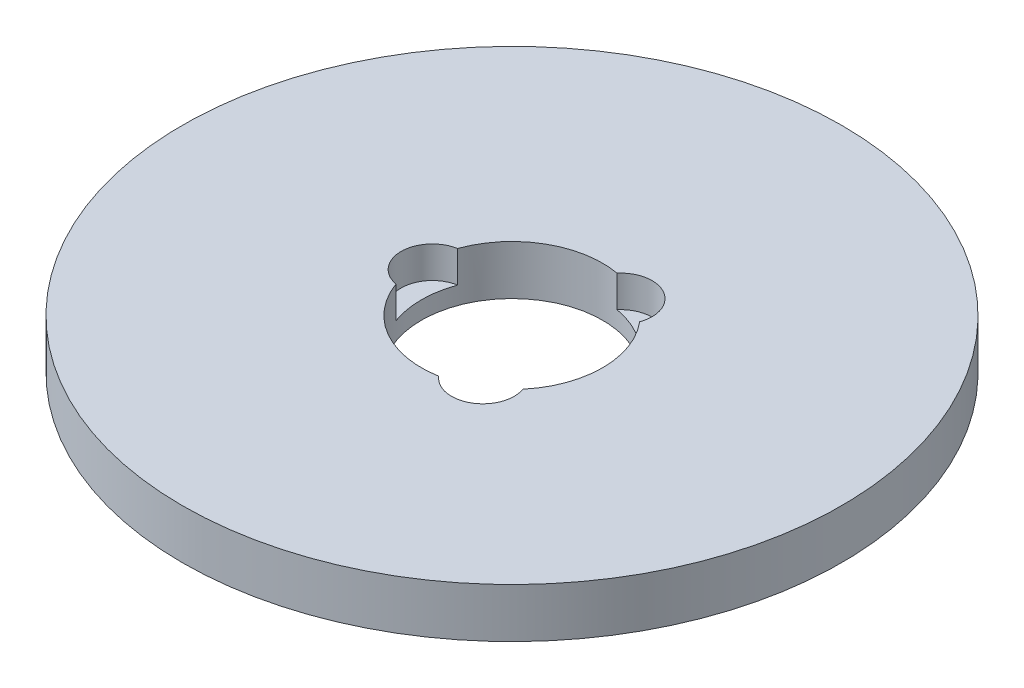
ISO-10303-21;
HEADER;
FILE_DESCRIPTION(('STEP AP214'),'2;1');
FILE_NAME('part.step','',(''),(''),'','','');
FILE_SCHEMA(('AUTOMOTIVE_DESIGN { 1 0 10303 214 1 1 1 1 }'));
ENDSEC;
DATA;
#1=APPLICATION_CONTEXT('core data for automotive mechanical design processes');
#2=APPLICATION_PROTOCOL_DEFINITION('international standard','automotive_design',2000,#1);
#3=PRODUCT_CONTEXT('',#1,'mechanical');
#4=PRODUCT('Part','Part','',(#3));
#5=PRODUCT_RELATED_PRODUCT_CATEGORY('part','',(#4));
#6=PRODUCT_DEFINITION_FORMATION('','',#4);
#7=PRODUCT_DEFINITION_CONTEXT('part definition',#1,'design');
#8=PRODUCT_DEFINITION('design','',#6,#7);
#9=PRODUCT_DEFINITION_SHAPE('','',#8);
#10=(LENGTH_UNIT() NAMED_UNIT(*) SI_UNIT(.MILLI.,.METRE.));
#11=(NAMED_UNIT(*) PLANE_ANGLE_UNIT() SI_UNIT($,.RADIAN.));
#12=(NAMED_UNIT(*) SI_UNIT($,.STERADIAN.) SOLID_ANGLE_UNIT());
#13=UNCERTAINTY_MEASURE_WITH_UNIT(LENGTH_MEASURE(1.E-05),#10,'distance_accuracy_value','');
#14=(GEOMETRIC_REPRESENTATION_CONTEXT(3) GLOBAL_UNCERTAINTY_ASSIGNED_CONTEXT((#13)) GLOBAL_UNIT_ASSIGNED_CONTEXT((#10,
#11,#12)) REPRESENTATION_CONTEXT('',''));
#15=CARTESIAN_POINT('',(0.,0.,0.));
#16=DIRECTION('',(0.,0.,1.));
#17=DIRECTION('',(1.,0.,0.));
#18=AXIS2_PLACEMENT_3D('',#15,#16,#17);
#19=CARTESIAN_POINT('',(0.,15.,0.));
#20=DIRECTION('',(0.,-1.,0.));
#21=DIRECTION('',(0.,0.,-1.));
#22=AXIS2_PLACEMENT_3D('',#19,#20,#21);
#23=CYLINDRICAL_SURFACE('',#22,100.);
#24=CARTESIAN_POINT('',(0.,15.,0.));
#25=DIRECTION('',(0.,1.,0.));
#26=DIRECTION('',(0.,0.,1.));
#27=AXIS2_PLACEMENT_3D('',#24,#25,#26);
#28=CIRCLE('',#27,100.);
#29=CARTESIAN_POINT('',(0.,15.,100.));
#30=VERTEX_POINT('',#29);
#31=EDGE_CURVE('E130',#30,#30,#28,.T.);
#32=ORIENTED_EDGE('',*,*,#31,.F.);
#33=EDGE_LOOP('',(#32));
#34=FACE_BOUND('',#33,.T.);
#35=CARTESIAN_POINT('',(0.,0.,0.));
#36=DIRECTION('',(0.,1.,0.));
#37=DIRECTION('',(0.,0.,1.));
#38=AXIS2_PLACEMENT_3D('',#35,#36,#37);
#39=CIRCLE('',#38,100.);
#40=CARTESIAN_POINT('',(0.,0.,100.));
#41=VERTEX_POINT('',#40);
#42=EDGE_CURVE('E117',#41,#41,#39,.T.);
#43=ORIENTED_EDGE('',*,*,#42,.T.);
#44=EDGE_LOOP('',(#43));
#45=FACE_BOUND('',#44,.T.);
#46=ADVANCED_FACE('F39',(#34,#45),#23,.T.);
#47=CARTESIAN_POINT('',(0.,15.,0.));
#48=DIRECTION('',(0.,1.,0.));
#49=DIRECTION('',(0.,0.,1.));
#50=AXIS2_PLACEMENT_3D('',#47,#48,#49);
#51=PLANE('',#50);
#52=CARTESIAN_POINT('',(12.0763277355072,15.,20.9168132067514));
#53=DIRECTION('',(0.,1.,0.));
#54=DIRECTION('',(0.866025403784436,0.,-0.500000000000004));
#55=AXIS2_PLACEMENT_3D('',#52,#53,#54);
#56=CIRCLE('',#55,9.5091254066598);
#57=CARTESIAN_POINT('',(4.82871010195015,15.,27.0727456817982));
#58=VERTEX_POINT('',#57);
#59=CARTESIAN_POINT('',(21.0313304596578,15.,17.7181584566983));
#60=VERTEX_POINT('',#59);
#61=EDGE_CURVE('E148',#58,#60,#56,.T.);
#62=ORIENTED_EDGE('',*,*,#61,.F.);
#63=CARTESIAN_POINT('',(0.,15.,0.));
#64=DIRECTION('',(0.,1.,0.));
#65=DIRECTION('',(0.,0.,1.));
#66=AXIS2_PLACEMENT_3D('',#63,#64,#65);
#67=CIRCLE('',#66,27.5);
#68=CARTESIAN_POINT('',(-25.8600405616078,15.,9.35458722509985));
#69=VERTEX_POINT('',#68);
#70=EDGE_CURVE('E113',#69,#58,#67,.T.);
#71=ORIENTED_EDGE('',*,*,#70,.F.);
#72=CARTESIAN_POINT('',(-24.1526554710141,15.,0.));
#73=DIRECTION('',(0.,1.,0.));
#74=DIRECTION('',(0.,0.,1.));
#75=AXIS2_PLACEMENT_3D('',#72,#73,#74);
#76=CIRCLE('',#75,9.5091254066598);
#77=CARTESIAN_POINT('',(-25.8600405616078,15.,-9.35458722509985));
#78=VERTEX_POINT('',#77);
#79=EDGE_CURVE('E125',#78,#69,#76,.T.);
#80=ORIENTED_EDGE('',*,*,#79,.F.);
#81=CARTESIAN_POINT('',(4.82871010194978,15.,-27.0727456817983));
#82=VERTEX_POINT('',#81);
#83=EDGE_CURVE('E107',#82,#78,#67,.T.);
#84=ORIENTED_EDGE('',*,*,#83,.F.);
#85=CARTESIAN_POINT('',(12.0763277355069,15.,-20.9168132067515));
#86=DIRECTION('',(0.,1.,0.));
#87=DIRECTION('',(-0.866025403784443,0.,-0.499999999999992));
#88=AXIS2_PLACEMENT_3D('',#85,#86,#87);
#89=CIRCLE('',#88,9.5091254066598);
#90=CARTESIAN_POINT('',(21.0313304596576,15.,-17.7181584566986));
#91=VERTEX_POINT('',#90);
#92=EDGE_CURVE('E95',#91,#82,#89,.T.);
#93=ORIENTED_EDGE('',*,*,#92,.F.);
#94=EDGE_CURVE('E106',#60,#91,#67,.T.);
#95=ORIENTED_EDGE('',*,*,#94,.F.);
#96=EDGE_LOOP('',(#62,#71,#80,#84,#93,#95));
#97=FACE_BOUND('',#96,.T.);
#98=ORIENTED_EDGE('',*,*,#31,.T.);
#99=EDGE_LOOP('',(#98));
#100=FACE_BOUND('',#99,.T.);
#101=ADVANCED_FACE('F102',(#97,#100),#51,.T.);
#102=CARTESIAN_POINT('',(0.,0.,0.));
#103=DIRECTION('',(0.,1.,0.));
#104=DIRECTION('',(0.,0.,1.));
#105=AXIS2_PLACEMENT_3D('',#102,#103,#104);
#106=PLANE('',#105);
#107=CARTESIAN_POINT('',(0.,0.,0.));
#108=DIRECTION('',(0.,1.,0.));
#109=DIRECTION('',(0.,0.,1.));
#110=AXIS2_PLACEMENT_3D('',#107,#108,#109);
#111=CIRCLE('',#110,27.5);
#112=CARTESIAN_POINT('',(0.,0.,27.5));
#113=VERTEX_POINT('',#112);
#114=EDGE_CURVE('E118',#113,#113,#111,.T.);
#115=ORIENTED_EDGE('',*,*,#114,.T.);
#116=EDGE_LOOP('',(#115));
#117=FACE_BOUND('',#116,.T.);
#118=ORIENTED_EDGE('',*,*,#42,.F.);
#119=EDGE_LOOP('',(#118));
#120=FACE_BOUND('',#119,.T.);
#121=ADVANCED_FACE('F161',(#117,#120),#106,.F.);
#122=CARTESIAN_POINT('',(0.,15.,0.));
#123=DIRECTION('',(0.,-1.,0.));
#124=DIRECTION('',(0.,0.,-1.));
#125=AXIS2_PLACEMENT_3D('',#122,#123,#124);
#126=CYLINDRICAL_SURFACE('',#125,27.5);
#127=DIRECTION('',(0.,1.,0.));
#128=VECTOR('',#127,1.);
#129=CARTESIAN_POINT('',(4.82871010195016,10.1903430932067,27.0727456817982));
#130=LINE('',#129,#128);
#131=CARTESIAN_POINT('',(4.82871010195015,5.38068618641333,27.0727456817982));
#132=VERTEX_POINT('',#131);
#133=EDGE_CURVE('E11',#132,#58,#130,.T.);
#134=ORIENTED_EDGE('',*,*,#133,.F.);
#135=CARTESIAN_POINT('',(0.,5.38068618641333,0.));
#136=DIRECTION('',(0.,1.,0.));
#137=DIRECTION('',(0.,0.,1.));
#138=AXIS2_PLACEMENT_3D('',#135,#136,#137);
#139=CIRCLE('',#138,27.5);
#140=CARTESIAN_POINT('',(21.0313304596578,5.38068618641333,17.7181584566983));
#141=VERTEX_POINT('',#140);
#142=EDGE_CURVE('E100',#132,#141,#139,.T.);
#143=ORIENTED_EDGE('',*,*,#142,.T.);
#144=DIRECTION('',(0.,1.,0.));
#145=VECTOR('',#144,1.);
#146=CARTESIAN_POINT('',(21.0313304596578,10.1903430932067,17.7181584566983));
#147=LINE('',#146,#145);
#148=EDGE_CURVE('E46',#60,#141,#147,.F.);
#149=ORIENTED_EDGE('',*,*,#148,.F.);
#150=ORIENTED_EDGE('',*,*,#94,.T.);
#151=DIRECTION('',(0.,1.,0.));
#152=VECTOR('',#151,1.);
#153=CARTESIAN_POINT('',(21.0313304596576,10.1903430932067,-17.7181584566986));
#154=LINE('',#153,#152);
#155=CARTESIAN_POINT('',(21.0313304596576,5.38068618641333,-17.7181584566986));
#156=VERTEX_POINT('',#155);
#157=EDGE_CURVE('E90',#156,#91,#154,.T.);
#158=ORIENTED_EDGE('',*,*,#157,.F.);
#159=CARTESIAN_POINT('',(0.,5.38068618641333,0.));
#160=DIRECTION('',(0.,1.,0.));
#161=DIRECTION('',(0.,0.,1.));
#162=AXIS2_PLACEMENT_3D('',#159,#160,#161);
#163=CIRCLE('',#162,27.5);
#164=CARTESIAN_POINT('',(4.82871010194978,5.38068618641333,-27.0727456817983));
#165=VERTEX_POINT('',#164);
#166=EDGE_CURVE('E143',#156,#165,#163,.T.);
#167=ORIENTED_EDGE('',*,*,#166,.T.);
#168=DIRECTION('',(0.,1.,0.));
#169=VECTOR('',#168,1.);
#170=CARTESIAN_POINT('',(4.82871010194978,10.1903430932067,-27.0727456817983));
#171=LINE('',#170,#169);
#172=EDGE_CURVE('E98',#82,#165,#171,.F.);
#173=ORIENTED_EDGE('',*,*,#172,.F.);
#174=ORIENTED_EDGE('',*,*,#83,.T.);
#175=DIRECTION('',(0.,1.,0.));
#176=VECTOR('',#175,1.);
#177=CARTESIAN_POINT('',(-25.8600405616078,10.1903430932067,-9.35458722509985));
#178=LINE('',#177,#176);
#179=CARTESIAN_POINT('',(-25.8600405616078,5.38068618641333,-9.35458722509985));
#180=VERTEX_POINT('',#179);
#181=EDGE_CURVE('E137',#180,#78,#178,.T.);
#182=ORIENTED_EDGE('',*,*,#181,.F.);
#183=CARTESIAN_POINT('',(0.,5.38068618641333,0.));
#184=DIRECTION('',(0.,1.,0.));
#185=DIRECTION('',(0.,0.,1.));
#186=AXIS2_PLACEMENT_3D('',#183,#184,#185);
#187=CIRCLE('',#186,27.5);
#188=CARTESIAN_POINT('',(-25.8600405616078,5.38068618641333,9.35458722509985));
#189=VERTEX_POINT('',#188);
#190=EDGE_CURVE('E128',#180,#189,#187,.T.);
#191=ORIENTED_EDGE('',*,*,#190,.T.);
#192=DIRECTION('',(0.,1.,0.));
#193=VECTOR('',#192,1.);
#194=CARTESIAN_POINT('',(-25.8600405616078,10.1903430932067,9.35458722509985));
#195=LINE('',#194,#193);
#196=EDGE_CURVE('E134',#69,#189,#195,.F.);
#197=ORIENTED_EDGE('',*,*,#196,.F.);
#198=ORIENTED_EDGE('',*,*,#70,.T.);
#199=EDGE_LOOP('',(#134,#143,#149,#150,#158,#167,#173,#174,#182,#191,#197,#198));
#200=FACE_BOUND('',#199,.T.);
#201=ORIENTED_EDGE('',*,*,#114,.F.);
#202=EDGE_LOOP('',(#201));
#203=FACE_BOUND('',#202,.T.);
#204=ADVANCED_FACE('F115',(#200,#203),#126,.F.);
#205=CARTESIAN_POINT('',(-24.1526554710141,5.38068618641333,0.));
#206=DIRECTION('',(0.,1.,0.));
#207=DIRECTION('',(0.,0.,1.));
#208=AXIS2_PLACEMENT_3D('',#205,#206,#207);
#209=CYLINDRICAL_SURFACE('',#208,9.5091254066598);
#210=ORIENTED_EDGE('',*,*,#181,.T.);
#211=ORIENTED_EDGE('',*,*,#79,.T.);
#212=ORIENTED_EDGE('',*,*,#196,.T.);
#213=CARTESIAN_POINT('',(-24.1526554710141,5.38068618641333,0.));
#214=DIRECTION('',(0.,1.,0.));
#215=DIRECTION('',(0.,0.,1.));
#216=AXIS2_PLACEMENT_3D('',#213,#214,#215);
#217=CIRCLE('',#216,9.5091254066598);
#218=EDGE_CURVE('E127',#180,#189,#217,.T.);
#219=ORIENTED_EDGE('',*,*,#218,.F.);
#220=EDGE_LOOP('',(#210,#211,#212,#219));
#221=FACE_BOUND('',#220,.T.);
#222=ADVANCED_FACE('F175',(#221),#209,.F.);
#223=CARTESIAN_POINT('',(-24.1526554710141,5.38068618641333,0.));
#224=DIRECTION('',(0.,1.,0.));
#225=DIRECTION('',(0.,0.,1.));
#226=AXIS2_PLACEMENT_3D('',#223,#224,#225);
#227=PLANE('',#226);
#228=ORIENTED_EDGE('',*,*,#218,.T.);
#229=ORIENTED_EDGE('',*,*,#190,.F.);
#230=EDGE_LOOP('',(#228,#229));
#231=FACE_BOUND('',#230,.T.);
#232=ADVANCED_FACE('F176',(#231),#227,.T.);
#233=CARTESIAN_POINT('',(12.0763277355069,5.38068618641333,-20.9168132067515));
#234=DIRECTION('',(0.,1.,0.));
#235=DIRECTION('',(0.,0.,1.));
#236=AXIS2_PLACEMENT_3D('',#233,#234,#235);
#237=CYLINDRICAL_SURFACE('',#236,9.5091254066598);
#238=ORIENTED_EDGE('',*,*,#157,.T.);
#239=ORIENTED_EDGE('',*,*,#92,.T.);
#240=ORIENTED_EDGE('',*,*,#172,.T.);
#241=CARTESIAN_POINT('',(12.0763277355069,5.38068618641333,-20.9168132067515));
#242=DIRECTION('',(0.,1.,0.));
#243=DIRECTION('',(-0.866025403784443,0.,-0.499999999999992));
#244=AXIS2_PLACEMENT_3D('',#241,#242,#243);
#245=CIRCLE('',#244,9.5091254066598);
#246=EDGE_CURVE('E56',#156,#165,#245,.T.);
#247=ORIENTED_EDGE('',*,*,#246,.F.);
#248=EDGE_LOOP('',(#238,#239,#240,#247));
#249=FACE_BOUND('',#248,.T.);
#250=ADVANCED_FACE('F93',(#249),#237,.F.);
#251=CARTESIAN_POINT('',(12.0763277355069,5.38068618641333,-20.9168132067515));
#252=DIRECTION('',(0.,1.,0.));
#253=DIRECTION('',(-0.866025403784443,0.,-0.499999999999992));
#254=AXIS2_PLACEMENT_3D('',#251,#252,#253);
#255=PLANE('',#254);
#256=ORIENTED_EDGE('',*,*,#246,.T.);
#257=ORIENTED_EDGE('',*,*,#166,.F.);
#258=EDGE_LOOP('',(#256,#257));
#259=FACE_BOUND('',#258,.T.);
#260=ADVANCED_FACE('F153',(#259),#255,.T.);
#261=CARTESIAN_POINT('',(12.0763277355072,5.38068618641333,20.9168132067514));
#262=DIRECTION('',(0.,1.,0.));
#263=DIRECTION('',(0.,0.,1.));
#264=AXIS2_PLACEMENT_3D('',#261,#262,#263);
#265=CYLINDRICAL_SURFACE('',#264,9.5091254066598);
#266=ORIENTED_EDGE('',*,*,#133,.T.);
#267=ORIENTED_EDGE('',*,*,#61,.T.);
#268=ORIENTED_EDGE('',*,*,#148,.T.);
#269=CARTESIAN_POINT('',(12.0763277355072,5.38068618641333,20.9168132067514));
#270=DIRECTION('',(0.,1.,0.));
#271=DIRECTION('',(0.866025403784436,0.,-0.500000000000004));
#272=AXIS2_PLACEMENT_3D('',#269,#270,#271);
#273=CIRCLE('',#272,9.5091254066598);
#274=EDGE_CURVE('E55',#132,#141,#273,.T.);
#275=ORIENTED_EDGE('',*,*,#274,.F.);
#276=EDGE_LOOP('',(#266,#267,#268,#275));
#277=FACE_BOUND('',#276,.T.);
#278=ADVANCED_FACE('F144',(#277),#265,.F.);
#279=CARTESIAN_POINT('',(12.0763277355072,5.38068618641333,20.9168132067514));
#280=DIRECTION('',(0.,1.,0.));
#281=DIRECTION('',(0.866025403784436,0.,-0.500000000000004));
#282=AXIS2_PLACEMENT_3D('',#279,#280,#281);
#283=PLANE('',#282);
#284=ORIENTED_EDGE('',*,*,#274,.T.);
#285=ORIENTED_EDGE('',*,*,#142,.F.);
#286=EDGE_LOOP('',(#284,#285));
#287=FACE_BOUND('',#286,.T.);
#288=ADVANCED_FACE('F150',(#287),#283,.T.);
#289=CLOSED_SHELL('',(#46,#101,#121,#204,#222,#232,#250,#260,#278,#288));
#290=MANIFOLD_SOLID_BREP('B2',#289);
#291=ADVANCED_BREP_SHAPE_REPRESENTATION('',(#18,#290),#14);
#292=SHAPE_DEFINITION_REPRESENTATION(#9,#291);
ENDSEC;
END-ISO-10303-21;
